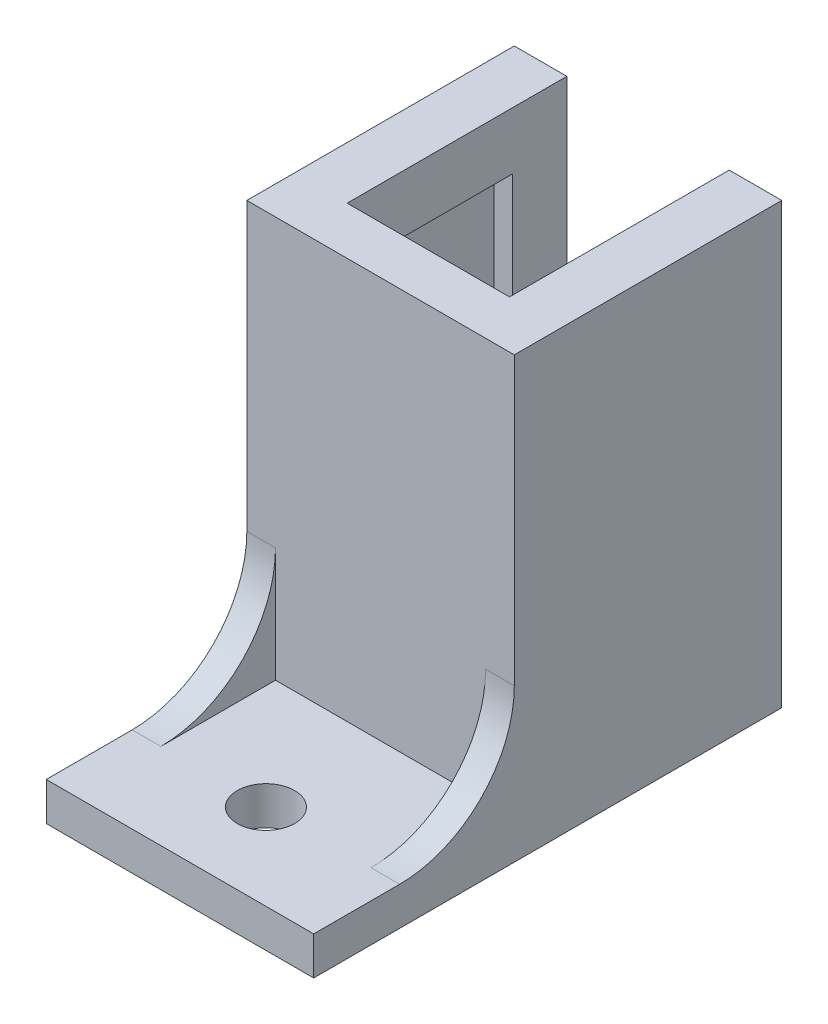
ISO-10303-21;
HEADER;
FILE_DESCRIPTION(('STEP AP214'),'2;1');
FILE_NAME('part.step','',(''),(''),'','','');
FILE_SCHEMA(('AUTOMOTIVE_DESIGN { 1 0 10303 214 1 1 1 1 }'));
ENDSEC;
DATA;
#1=APPLICATION_CONTEXT('core data for automotive mechanical design processes');
#2=APPLICATION_PROTOCOL_DEFINITION('international standard','automotive_design',2000,#1);
#3=PRODUCT_CONTEXT('',#1,'mechanical');
#4=PRODUCT('Part','Part','',(#3));
#5=PRODUCT_RELATED_PRODUCT_CATEGORY('part','',(#4));
#6=PRODUCT_DEFINITION_FORMATION('','',#4);
#7=PRODUCT_DEFINITION_CONTEXT('part definition',#1,'design');
#8=PRODUCT_DEFINITION('design','',#6,#7);
#9=PRODUCT_DEFINITION_SHAPE('','',#8);
#10=(LENGTH_UNIT() NAMED_UNIT(*) SI_UNIT(.MILLI.,.METRE.));
#11=(NAMED_UNIT(*) PLANE_ANGLE_UNIT() SI_UNIT($,.RADIAN.));
#12=(NAMED_UNIT(*) SI_UNIT($,.STERADIAN.) SOLID_ANGLE_UNIT());
#13=UNCERTAINTY_MEASURE_WITH_UNIT(LENGTH_MEASURE(1.E-05),#10,'distance_accuracy_value','');
#14=(GEOMETRIC_REPRESENTATION_CONTEXT(3) GLOBAL_UNCERTAINTY_ASSIGNED_CONTEXT((#13)) GLOBAL_UNIT_ASSIGNED_CONTEXT((#10,
#11,#12)) REPRESENTATION_CONTEXT('',''));
#15=CARTESIAN_POINT('',(0.,0.,0.));
#16=DIRECTION('',(0.,0.,1.));
#17=DIRECTION('',(1.,0.,0.));
#18=AXIS2_PLACEMENT_3D('',#15,#16,#17);
#19=CARTESIAN_POINT('',(0.,0.,0.));
#20=DIRECTION('',(0.,0.,1.));
#21=DIRECTION('',(1.,0.,0.));
#22=AXIS2_PLACEMENT_3D('',#19,#20,#21);
#23=PLANE('',#22);
#24=DIRECTION('',(0.,-1.,0.));
#25=VECTOR('',#24,1.);
#26=CARTESIAN_POINT('',(4.25,8.5,0.));
#27=LINE('',#26,#25);
#28=CARTESIAN_POINT('',(4.25,11.5,0.));
#29=VERTEX_POINT('',#28);
#30=CARTESIAN_POINT('',(4.25,-11.5,0.));
#31=VERTEX_POINT('',#30);
#32=EDGE_CURVE('E340',#29,#31,#27,.T.);
#33=ORIENTED_EDGE('',*,*,#32,.F.);
#34=DIRECTION('',(-1.,0.,0.));
#35=VECTOR('',#34,1.);
#36=CARTESIAN_POINT('',(0.,11.5,0.));
#37=LINE('',#36,#35);
#38=CARTESIAN_POINT('',(7.,11.5,0.));
#39=VERTEX_POINT('',#38);
#40=EDGE_CURVE('E200',#39,#29,#37,.T.);
#41=ORIENTED_EDGE('',*,*,#40,.F.);
#42=DIRECTION('',(0.,-1.,0.));
#43=VECTOR('',#42,1.);
#44=CARTESIAN_POINT('',(7.,0.,0.));
#45=LINE('',#44,#43);
#46=CARTESIAN_POINT('',(7.,-11.5,0.));
#47=VERTEX_POINT('',#46);
#48=EDGE_CURVE('E357',#39,#47,#45,.T.);
#49=ORIENTED_EDGE('',*,*,#48,.T.);
#50=DIRECTION('',(-1.,0.,0.));
#51=VECTOR('',#50,1.);
#52=CARTESIAN_POINT('',(0.,-11.5,0.));
#53=LINE('',#52,#51);
#54=EDGE_CURVE('E372',#47,#31,#53,.T.);
#55=ORIENTED_EDGE('',*,*,#54,.T.);
#56=EDGE_LOOP('',(#33,#41,#49,#55));
#57=FACE_BOUND('',#56,.T.);
#58=ADVANCED_FACE('F41',(#57),#23,.F.);
#59=CARTESIAN_POINT('',(0.,8.5,0.));
#60=DIRECTION('',(0.,-1.,0.));
#61=DIRECTION('',(1.,0.,0.));
#62=AXIS2_PLACEMENT_3D('',#59,#60,#61);
#63=PLANE('',#62);
#64=DIRECTION('',(0.,0.,1.));
#65=VECTOR('',#64,1.);
#66=CARTESIAN_POINT('',(4.25,8.5,0.));
#67=LINE('',#66,#65);
#68=CARTESIAN_POINT('',(4.25,8.5,2.85));
#69=VERTEX_POINT('',#68);
#70=CARTESIAN_POINT('',(4.25,8.5,11.5));
#71=VERTEX_POINT('',#70);
#72=EDGE_CURVE('E11',#69,#71,#67,.T.);
#73=ORIENTED_EDGE('',*,*,#72,.F.);
#74=DIRECTION('',(-1.,0.,0.));
#75=VECTOR('',#74,1.);
#76=CARTESIAN_POINT('',(0.,8.5,2.85));
#77=LINE('',#76,#75);
#78=CARTESIAN_POINT('',(5.2,8.5,2.85));
#79=VERTEX_POINT('',#78);
#80=EDGE_CURVE('E296',#79,#69,#77,.T.);
#81=ORIENTED_EDGE('',*,*,#80,.F.);
#82=DIRECTION('',(0.,0.,1.));
#83=VECTOR('',#82,1.);
#84=CARTESIAN_POINT('',(5.2,8.5,0.));
#85=LINE('',#84,#83);
#86=CARTESIAN_POINT('',(5.2,8.5,11.5));
#87=VERTEX_POINT('',#86);
#88=EDGE_CURVE('E297',#79,#87,#85,.T.);
#89=ORIENTED_EDGE('',*,*,#88,.T.);
#90=DIRECTION('',(-1.,0.,0.));
#91=VECTOR('',#90,1.);
#92=CARTESIAN_POINT('',(0.,8.5,11.5));
#93=LINE('',#92,#91);
#94=EDGE_CURVE('E302',#87,#71,#93,.T.);
#95=ORIENTED_EDGE('',*,*,#94,.T.);
#96=EDGE_LOOP('',(#73,#81,#89,#95));
#97=FACE_BOUND('',#96,.T.);
#98=ADVANCED_FACE('F461',(#97),#63,.T.);
#99=CARTESIAN_POINT('',(0.,0.,14.));
#100=DIRECTION('',(0.,0.,1.));
#101=DIRECTION('',(1.,0.,0.));
#102=AXIS2_PLACEMENT_3D('',#99,#100,#101);
#103=PLANE('',#102);
#104=DIRECTION('',(0.,-1.,0.));
#105=VECTOR('',#104,1.);
#106=CARTESIAN_POINT('',(5.5,-3.5,14.));
#107=LINE('',#106,#105);
#108=CARTESIAN_POINT('',(5.5,-3.5,14.));
#109=VERTEX_POINT('',#108);
#110=CARTESIAN_POINT('',(5.5,-9.5,14.));
#111=VERTEX_POINT('',#110);
#112=EDGE_CURVE('E217',#109,#111,#107,.T.);
#113=ORIENTED_EDGE('',*,*,#112,.F.);
#114=DIRECTION('',(1.,0.,0.));
#115=VECTOR('',#114,1.);
#116=CARTESIAN_POINT('',(5.5,-3.5,14.));
#117=LINE('',#116,#115);
#118=CARTESIAN_POINT('',(7.,-3.5,14.));
#119=VERTEX_POINT('',#118);
#120=EDGE_CURVE('E223',#109,#119,#117,.T.);
#121=ORIENTED_EDGE('',*,*,#120,.T.);
#122=DIRECTION('',(0.,-1.,0.));
#123=VECTOR('',#122,1.);
#124=CARTESIAN_POINT('',(7.,0.,14.));
#125=LINE('',#124,#123);
#126=CARTESIAN_POINT('',(7.,11.5,14.));
#127=VERTEX_POINT('',#126);
#128=EDGE_CURVE('E361',#127,#119,#125,.T.);
#129=ORIENTED_EDGE('',*,*,#128,.F.);
#130=DIRECTION('',(-1.,0.,0.));
#131=VECTOR('',#130,1.);
#132=CARTESIAN_POINT('',(0.,11.5,14.));
#133=LINE('',#132,#131);
#134=CARTESIAN_POINT('',(-7.,11.5,14.));
#135=VERTEX_POINT('',#134);
#136=EDGE_CURVE('E352',#127,#135,#133,.T.);
#137=ORIENTED_EDGE('',*,*,#136,.T.);
#138=DIRECTION('',(0.,-1.,0.));
#139=VECTOR('',#138,1.);
#140=CARTESIAN_POINT('',(-7.,0.,14.));
#141=LINE('',#140,#139);
#142=CARTESIAN_POINT('',(-7.,-3.5,14.));
#143=VERTEX_POINT('',#142);
#144=EDGE_CURVE('E356',#135,#143,#141,.T.);
#145=ORIENTED_EDGE('',*,*,#144,.T.);
#146=DIRECTION('',(-1.,0.,0.));
#147=VECTOR('',#146,1.);
#148=CARTESIAN_POINT('',(-5.5,-3.5,14.));
#149=LINE('',#148,#147);
#150=CARTESIAN_POINT('',(-5.5,-3.5,14.));
#151=VERTEX_POINT('',#150);
#152=EDGE_CURVE('E242',#151,#143,#149,.T.);
#153=ORIENTED_EDGE('',*,*,#152,.F.);
#154=DIRECTION('',(0.,-1.,0.));
#155=VECTOR('',#154,1.);
#156=CARTESIAN_POINT('',(-5.5,-3.5,14.));
#157=LINE('',#156,#155);
#158=CARTESIAN_POINT('',(-5.5,-9.5,14.));
#159=VERTEX_POINT('',#158);
#160=EDGE_CURVE('E234',#151,#159,#157,.T.);
#161=ORIENTED_EDGE('',*,*,#160,.T.);
#162=DIRECTION('',(1.,0.,0.));
#163=VECTOR('',#162,1.);
#164=CARTESIAN_POINT('',(7.,-9.5,14.));
#165=LINE('',#164,#163);
#166=EDGE_CURVE('E272',#159,#111,#165,.T.);
#167=ORIENTED_EDGE('',*,*,#166,.T.);
#168=EDGE_LOOP('',(#113,#121,#129,#137,#145,#153,#161,#167));
#169=FACE_BOUND('',#168,.T.);
#170=ADVANCED_FACE('F420',(#169),#103,.T.);
#171=CARTESIAN_POINT('',(0.,-9.5,0.));
#172=DIRECTION('',(0.,-1.,0.));
#173=DIRECTION('',(1.,0.,0.));
#174=AXIS2_PLACEMENT_3D('',#171,#172,#173);
#175=PLANE('',#174);
#176=CARTESIAN_POINT('',(0.,-9.5,20.));
#177=DIRECTION('',(0.,-1.,0.));
#178=DIRECTION('',(1.,0.,0.));
#179=AXIS2_PLACEMENT_3D('',#176,#177,#178);
#180=CIRCLE('',#179,1.5);
#181=CARTESIAN_POINT('',(1.5,-9.5,20.));
#182=VERTEX_POINT('',#181);
#183=EDGE_CURVE('E253',#182,#182,#180,.T.);
#184=ORIENTED_EDGE('',*,*,#183,.T.);
#185=EDGE_LOOP('',(#184));
#186=FACE_BOUND('',#185,.T.);
#187=DIRECTION('',(1.,0.,0.));
#188=VECTOR('',#187,1.);
#189=CARTESIAN_POINT('',(5.5,-9.5,20.));
#190=LINE('',#189,#188);
#191=CARTESIAN_POINT('',(5.5,-9.5,20.));
#192=VERTEX_POINT('',#191);
#193=CARTESIAN_POINT('',(7.,-9.5,20.));
#194=VERTEX_POINT('',#193);
#195=EDGE_CURVE('E220',#192,#194,#190,.T.);
#196=ORIENTED_EDGE('',*,*,#195,.F.);
#197=DIRECTION('',(0.,0.,1.));
#198=VECTOR('',#197,1.);
#199=CARTESIAN_POINT('',(5.5,-9.5,14.));
#200=LINE('',#199,#198);
#201=EDGE_CURVE('E214',#111,#192,#200,.T.);
#202=ORIENTED_EDGE('',*,*,#201,.F.);
#203=ORIENTED_EDGE('',*,*,#166,.F.);
#204=DIRECTION('',(0.,0.,1.));
#205=VECTOR('',#204,1.);
#206=CARTESIAN_POINT('',(-5.5,-9.5,14.));
#207=LINE('',#206,#205);
#208=CARTESIAN_POINT('',(-5.5,-9.5,20.));
#209=VERTEX_POINT('',#208);
#210=EDGE_CURVE('E238',#159,#209,#207,.T.);
#211=ORIENTED_EDGE('',*,*,#210,.T.);
#212=DIRECTION('',(-1.,0.,0.));
#213=VECTOR('',#212,1.);
#214=CARTESIAN_POINT('',(-5.5,-9.5,20.));
#215=LINE('',#214,#213);
#216=CARTESIAN_POINT('',(-7.,-9.5,20.));
#217=VERTEX_POINT('',#216);
#218=EDGE_CURVE('E246',#209,#217,#215,.T.);
#219=ORIENTED_EDGE('',*,*,#218,.T.);
#220=DIRECTION('',(0.,0.,-1.));
#221=VECTOR('',#220,1.);
#222=CARTESIAN_POINT('',(-7.,-9.5,14.));
#223=LINE('',#222,#221);
#224=CARTESIAN_POINT('',(-7.,-9.5,24.5));
#225=VERTEX_POINT('',#224);
#226=EDGE_CURVE('E268',#225,#217,#223,.T.);
#227=ORIENTED_EDGE('',*,*,#226,.F.);
#228=DIRECTION('',(-1.,0.,0.));
#229=VECTOR('',#228,1.);
#230=CARTESIAN_POINT('',(7.,-9.5,24.5));
#231=LINE('',#230,#229);
#232=CARTESIAN_POINT('',(7.,-9.5,24.5));
#233=VERTEX_POINT('',#232);
#234=EDGE_CURVE('E264',#233,#225,#231,.T.);
#235=ORIENTED_EDGE('',*,*,#234,.F.);
#236=DIRECTION('',(0.,0.,1.));
#237=VECTOR('',#236,1.);
#238=CARTESIAN_POINT('',(7.,-9.5,14.));
#239=LINE('',#238,#237);
#240=EDGE_CURVE('E261',#194,#233,#239,.T.);
#241=ORIENTED_EDGE('',*,*,#240,.F.);
#242=EDGE_LOOP('',(#196,#202,#203,#211,#219,#227,#235,#241));
#243=FACE_BOUND('',#242,.T.);
#244=ADVANCED_FACE('F415',(#186,#243),#175,.F.);
#245=CARTESIAN_POINT('',(0.,-11.5,14.));
#246=DIRECTION('',(0.,-1.,0.));
#247=DIRECTION('',(1.,0.,0.));
#248=AXIS2_PLACEMENT_3D('',#245,#246,#247);
#249=PLANE('',#248);
#250=DIRECTION('',(-1.,0.,0.));
#251=VECTOR('',#250,1.);
#252=CARTESIAN_POINT('',(0.,-11.5,2.85));
#253=LINE('',#252,#251);
#254=CARTESIAN_POINT('',(5.2,-11.5,2.85));
#255=VERTEX_POINT('',#254);
#256=CARTESIAN_POINT('',(4.25,-11.5,2.85));
#257=VERTEX_POINT('',#256);
#258=EDGE_CURVE('E314',#255,#257,#253,.T.);
#259=ORIENTED_EDGE('',*,*,#258,.T.);
#260=DIRECTION('',(0.,0.,-1.));
#261=VECTOR('',#260,1.);
#262=CARTESIAN_POINT('',(4.25,-11.5,0.));
#263=LINE('',#262,#261);
#264=EDGE_CURVE('E317',#257,#31,#263,.T.);
#265=ORIENTED_EDGE('',*,*,#264,.T.);
#266=ORIENTED_EDGE('',*,*,#54,.F.);
#267=DIRECTION('',(0.,0.,-1.));
#268=VECTOR('',#267,1.);
#269=CARTESIAN_POINT('',(7.,-11.5,14.));
#270=LINE('',#269,#268);
#271=CARTESIAN_POINT('',(7.,-11.5,24.5));
#272=VERTEX_POINT('',#271);
#273=EDGE_CURVE('E381',#272,#47,#270,.T.);
#274=ORIENTED_EDGE('',*,*,#273,.F.);
#275=DIRECTION('',(-1.,0.,0.));
#276=VECTOR('',#275,1.);
#277=CARTESIAN_POINT('',(7.,-11.5,24.5));
#278=LINE('',#277,#276);
#279=CARTESIAN_POINT('',(-7.,-11.5,24.5));
#280=VERTEX_POINT('',#279);
#281=EDGE_CURVE('E257',#272,#280,#278,.T.);
#282=ORIENTED_EDGE('',*,*,#281,.T.);
#283=DIRECTION('',(0.,0.,-1.));
#284=VECTOR('',#283,1.);
#285=CARTESIAN_POINT('',(-7.,-11.5,14.));
#286=LINE('',#285,#284);
#287=CARTESIAN_POINT('',(-7.,-11.5,0.));
#288=VERTEX_POINT('',#287);
#289=EDGE_CURVE('E384',#280,#288,#286,.T.);
#290=ORIENTED_EDGE('',*,*,#289,.T.);
#291=CARTESIAN_POINT('',(-4.25,-11.5,0.));
#292=VERTEX_POINT('',#291);
#293=EDGE_CURVE('E371',#292,#288,#53,.T.);
#294=ORIENTED_EDGE('',*,*,#293,.F.);
#295=DIRECTION('',(0.,0.,-1.));
#296=VECTOR('',#295,1.);
#297=CARTESIAN_POINT('',(-4.25,-11.5,0.));
#298=LINE('',#297,#296);
#299=CARTESIAN_POINT('',(-4.25,-11.5,2.85));
#300=VERTEX_POINT('',#299);
#301=EDGE_CURVE('E313',#300,#292,#298,.T.);
#302=ORIENTED_EDGE('',*,*,#301,.F.);
#303=CARTESIAN_POINT('',(-5.2,-11.5,2.85));
#304=VERTEX_POINT('',#303);
#305=EDGE_CURVE('E309',#300,#304,#253,.T.);
#306=ORIENTED_EDGE('',*,*,#305,.T.);
#307=DIRECTION('',(0.,0.,1.));
#308=VECTOR('',#307,1.);
#309=CARTESIAN_POINT('',(-5.2,-11.5,0.));
#310=LINE('',#309,#308);
#311=CARTESIAN_POINT('',(-5.2,-11.5,11.5));
#312=VERTEX_POINT('',#311);
#313=EDGE_CURVE('E284',#304,#312,#310,.T.);
#314=ORIENTED_EDGE('',*,*,#313,.T.);
#315=DIRECTION('',(-1.,0.,0.));
#316=VECTOR('',#315,1.);
#317=CARTESIAN_POINT('',(0.,-11.5,11.5));
#318=LINE('',#317,#316);
#319=CARTESIAN_POINT('',(5.2,-11.5,11.5));
#320=VERTEX_POINT('',#319);
#321=EDGE_CURVE('E293',#320,#312,#318,.T.);
#322=ORIENTED_EDGE('',*,*,#321,.F.);
#323=DIRECTION('',(0.,0.,1.));
#324=VECTOR('',#323,1.);
#325=CARTESIAN_POINT('',(5.2,-11.5,0.));
#326=LINE('',#325,#324);
#327=EDGE_CURVE('E321',#255,#320,#326,.T.);
#328=ORIENTED_EDGE('',*,*,#327,.F.);
#329=EDGE_LOOP('',(#259,#265,#266,#274,#282,#290,#294,#302,#306,#314,#322,#328));
#330=FACE_BOUND('',#329,.T.);
#331=CARTESIAN_POINT('',(0.,-11.5,20.));
#332=DIRECTION('',(0.,-1.,0.));
#333=DIRECTION('',(1.,0.,0.));
#334=AXIS2_PLACEMENT_3D('',#331,#332,#333);
#335=CIRCLE('',#334,1.5);
#336=CARTESIAN_POINT('',(1.5,-11.5,20.));
#337=VERTEX_POINT('',#336);
#338=EDGE_CURVE('E250',#337,#337,#335,.T.);
#339=ORIENTED_EDGE('',*,*,#338,.F.);
#340=EDGE_LOOP('',(#339));
#341=FACE_BOUND('',#340,.T.);
#342=ADVANCED_FACE('F404',(#330,#341),#249,.T.);
#343=CARTESIAN_POINT('',(-4.25,11.5,0.));
#344=VERTEX_POINT('',#343);
#345=CARTESIAN_POINT('',(-7.,11.5,0.));
#346=VERTEX_POINT('',#345);
#347=EDGE_CURVE('E330',#344,#346,#37,.T.);
#348=ORIENTED_EDGE('',*,*,#347,.F.);
#349=DIRECTION('',(0.,-1.,0.));
#350=VECTOR('',#349,1.);
#351=CARTESIAN_POINT('',(-4.25,8.5,0.));
#352=LINE('',#351,#350);
#353=EDGE_CURVE('E343',#344,#292,#352,.T.);
#354=ORIENTED_EDGE('',*,*,#353,.T.);
#355=ORIENTED_EDGE('',*,*,#293,.T.);
#356=DIRECTION('',(0.,-1.,0.));
#357=VECTOR('',#356,1.);
#358=CARTESIAN_POINT('',(-7.,0.,0.));
#359=LINE('',#358,#357);
#360=EDGE_CURVE('E367',#346,#288,#359,.T.);
#361=ORIENTED_EDGE('',*,*,#360,.F.);
#362=EDGE_LOOP('',(#348,#354,#355,#361));
#363=FACE_BOUND('',#362,.T.);
#364=ADVANCED_FACE('F398',(#363),#23,.F.);
#365=CARTESIAN_POINT('',(0.,11.5,14.));
#366=DIRECTION('',(0.,-1.,0.));
#367=DIRECTION('',(1.,0.,0.));
#368=AXIS2_PLACEMENT_3D('',#365,#366,#367);
#369=PLANE('',#368);
#370=ORIENTED_EDGE('',*,*,#40,.T.);
#371=DIRECTION('',(0.,0.,1.));
#372=VECTOR('',#371,1.);
#373=CARTESIAN_POINT('',(4.25,11.5,0.));
#374=LINE('',#373,#372);
#375=CARTESIAN_POINT('',(4.25,11.5,11.5));
#376=VERTEX_POINT('',#375);
#377=EDGE_CURVE('E181',#29,#376,#374,.T.);
#378=ORIENTED_EDGE('',*,*,#377,.T.);
#379=DIRECTION('',(-1.,0.,0.));
#380=VECTOR('',#379,1.);
#381=CARTESIAN_POINT('',(4.25,11.5,11.5));
#382=LINE('',#381,#380);
#383=CARTESIAN_POINT('',(-4.25,11.5,11.5));
#384=VERTEX_POINT('',#383);
#385=EDGE_CURVE('E190',#376,#384,#382,.T.);
#386=ORIENTED_EDGE('',*,*,#385,.T.);
#387=DIRECTION('',(0.,0.,-1.));
#388=VECTOR('',#387,1.);
#389=CARTESIAN_POINT('',(-4.25,11.5,0.));
#390=LINE('',#389,#388);
#391=EDGE_CURVE('E187',#384,#344,#390,.T.);
#392=ORIENTED_EDGE('',*,*,#391,.T.);
#393=ORIENTED_EDGE('',*,*,#347,.T.);
#394=DIRECTION('',(0.,0.,-1.));
#395=VECTOR('',#394,1.);
#396=CARTESIAN_POINT('',(-7.,11.5,14.));
#397=LINE('',#396,#395);
#398=EDGE_CURVE('E50',#135,#346,#397,.T.);
#399=ORIENTED_EDGE('',*,*,#398,.F.);
#400=ORIENTED_EDGE('',*,*,#136,.F.);
#401=DIRECTION('',(0.,0.,-1.));
#402=VECTOR('',#401,1.);
#403=CARTESIAN_POINT('',(7.,11.5,14.));
#404=LINE('',#403,#402);
#405=EDGE_CURVE('E364',#127,#39,#404,.T.);
#406=ORIENTED_EDGE('',*,*,#405,.T.);
#407=EDGE_LOOP('',(#370,#378,#386,#392,#393,#399,#400,#406));
#408=FACE_BOUND('',#407,.T.);
#409=ADVANCED_FACE('F43',(#408),#369,.F.);
#410=CARTESIAN_POINT('',(-7.,0.,14.));
#411=DIRECTION('',(1.,0.,0.));
#412=DIRECTION('',(0.,1.,0.));
#413=AXIS2_PLACEMENT_3D('',#410,#411,#412);
#414=PLANE('',#413);
#415=ORIENTED_EDGE('',*,*,#360,.T.);
#416=ORIENTED_EDGE('',*,*,#289,.F.);
#417=DIRECTION('',(0.,-1.,0.));
#418=VECTOR('',#417,1.);
#419=CARTESIAN_POINT('',(-7.,-9.5,24.5));
#420=LINE('',#419,#418);
#421=EDGE_CURVE('E280',#225,#280,#420,.T.);
#422=ORIENTED_EDGE('',*,*,#421,.F.);
#423=ORIENTED_EDGE('',*,*,#226,.T.);
#424=CARTESIAN_POINT('',(-7.,-3.5,20.));
#425=DIRECTION('',(1.,0.,0.));
#426=DIRECTION('',(0.,1.,0.));
#427=AXIS2_PLACEMENT_3D('',#424,#425,#426);
#428=CIRCLE('',#427,6.);
#429=EDGE_CURVE('E227',#217,#143,#428,.T.);
#430=ORIENTED_EDGE('',*,*,#429,.T.);
#431=ORIENTED_EDGE('',*,*,#144,.F.);
#432=ORIENTED_EDGE('',*,*,#398,.T.);
#433=EDGE_LOOP('',(#415,#416,#422,#423,#430,#431,#432));
#434=FACE_BOUND('',#433,.T.);
#435=ADVANCED_FACE('F391',(#434),#414,.F.);
#436=CARTESIAN_POINT('',(7.,0.,14.));
#437=DIRECTION('',(1.,0.,0.));
#438=DIRECTION('',(0.,1.,0.));
#439=AXIS2_PLACEMENT_3D('',#436,#437,#438);
#440=PLANE('',#439);
#441=ORIENTED_EDGE('',*,*,#48,.F.);
#442=ORIENTED_EDGE('',*,*,#405,.F.);
#443=ORIENTED_EDGE('',*,*,#128,.T.);
#444=CARTESIAN_POINT('',(7.,-3.5,20.));
#445=DIRECTION('',(1.,0.,0.));
#446=DIRECTION('',(0.,1.,0.));
#447=AXIS2_PLACEMENT_3D('',#444,#445,#446);
#448=CIRCLE('',#447,6.);
#449=EDGE_CURVE('E64',#194,#119,#448,.T.);
#450=ORIENTED_EDGE('',*,*,#449,.F.);
#451=ORIENTED_EDGE('',*,*,#240,.T.);
#452=DIRECTION('',(0.,-1.,0.));
#453=VECTOR('',#452,1.);
#454=CARTESIAN_POINT('',(7.,-9.5,24.5));
#455=LINE('',#454,#453);
#456=EDGE_CURVE('E276',#233,#272,#455,.T.);
#457=ORIENTED_EDGE('',*,*,#456,.T.);
#458=ORIENTED_EDGE('',*,*,#273,.T.);
#459=EDGE_LOOP('',(#441,#442,#443,#450,#451,#457,#458));
#460=FACE_BOUND('',#459,.T.);
#461=ADVANCED_FACE('F423',(#460),#440,.T.);
#462=CARTESIAN_POINT('',(-5.2,8.5,0.));
#463=DIRECTION('',(1.,0.,0.));
#464=DIRECTION('',(0.,1.,0.));
#465=AXIS2_PLACEMENT_3D('',#462,#463,#464);
#466=PLANE('',#465);
#467=ORIENTED_EDGE('',*,*,#313,.F.);
#468=DIRECTION('',(0.,-1.,0.));
#469=VECTOR('',#468,1.);
#470=CARTESIAN_POINT('',(-5.2,8.5,2.85));
#471=LINE('',#470,#469);
#472=CARTESIAN_POINT('',(-5.2,8.5,2.85));
#473=VERTEX_POINT('',#472);
#474=EDGE_CURVE('E305',#473,#304,#471,.T.);
#475=ORIENTED_EDGE('',*,*,#474,.F.);
#476=DIRECTION('',(0.,0.,1.));
#477=VECTOR('',#476,1.);
#478=CARTESIAN_POINT('',(-5.2,8.5,0.));
#479=LINE('',#478,#477);
#480=CARTESIAN_POINT('',(-5.2,8.5,11.5));
#481=VERTEX_POINT('',#480);
#482=EDGE_CURVE('E288',#473,#481,#479,.T.);
#483=ORIENTED_EDGE('',*,*,#482,.T.);
#484=DIRECTION('',(0.,-1.,0.));
#485=VECTOR('',#484,1.);
#486=CARTESIAN_POINT('',(-5.2,8.5,11.5));
#487=LINE('',#486,#485);
#488=EDGE_CURVE('E327',#481,#312,#487,.T.);
#489=ORIENTED_EDGE('',*,*,#488,.T.);
#490=EDGE_LOOP('',(#467,#475,#483,#489));
#491=FACE_BOUND('',#490,.T.);
#492=ADVANCED_FACE('F443',(#491),#466,.T.);
#493=CARTESIAN_POINT('',(0.,8.5,11.5));
#494=DIRECTION('',(0.,0.,1.));
#495=DIRECTION('',(1.,0.,0.));
#496=AXIS2_PLACEMENT_3D('',#493,#494,#495);
#497=PLANE('',#496);
#498=ORIENTED_EDGE('',*,*,#321,.T.);
#499=ORIENTED_EDGE('',*,*,#488,.F.);
#500=CARTESIAN_POINT('',(-4.25,8.5,11.5));
#501=VERTEX_POINT('',#500);
#502=EDGE_CURVE('E301',#501,#481,#93,.T.);
#503=ORIENTED_EDGE('',*,*,#502,.F.);
#504=DIRECTION('',(0.,-1.,0.));
#505=VECTOR('',#504,1.);
#506=CARTESIAN_POINT('',(-4.25,11.5,11.5));
#507=LINE('',#506,#505);
#508=EDGE_CURVE('E186',#384,#501,#507,.T.);
#509=ORIENTED_EDGE('',*,*,#508,.F.);
#510=ORIENTED_EDGE('',*,*,#385,.F.);
#511=DIRECTION('',(0.,-1.,0.));
#512=VECTOR('',#511,1.);
#513=CARTESIAN_POINT('',(4.25,11.5,11.5));
#514=LINE('',#513,#512);
#515=EDGE_CURVE('E57',#376,#71,#514,.T.);
#516=ORIENTED_EDGE('',*,*,#515,.T.);
#517=ORIENTED_EDGE('',*,*,#94,.F.);
#518=DIRECTION('',(0.,-1.,0.));
#519=VECTOR('',#518,1.);
#520=CARTESIAN_POINT('',(5.2,8.5,11.5));
#521=LINE('',#520,#519);
#522=EDGE_CURVE('E331',#87,#320,#521,.T.);
#523=ORIENTED_EDGE('',*,*,#522,.T.);
#524=EDGE_LOOP('',(#498,#499,#503,#509,#510,#516,#517,#523));
#525=FACE_BOUND('',#524,.T.);
#526=ADVANCED_FACE('F192',(#525),#497,.F.);
#527=CARTESIAN_POINT('',(5.2,8.5,0.));
#528=DIRECTION('',(1.,0.,0.));
#529=DIRECTION('',(0.,1.,0.));
#530=AXIS2_PLACEMENT_3D('',#527,#528,#529);
#531=PLANE('',#530);
#532=ORIENTED_EDGE('',*,*,#327,.T.);
#533=ORIENTED_EDGE('',*,*,#522,.F.);
#534=ORIENTED_EDGE('',*,*,#88,.F.);
#535=DIRECTION('',(0.,-1.,0.));
#536=VECTOR('',#535,1.);
#537=CARTESIAN_POINT('',(5.2,8.5,2.85));
#538=LINE('',#537,#536);
#539=EDGE_CURVE('E334',#79,#255,#538,.T.);
#540=ORIENTED_EDGE('',*,*,#539,.T.);
#541=EDGE_LOOP('',(#532,#533,#534,#540));
#542=FACE_BOUND('',#541,.T.);
#543=ADVANCED_FACE('F491',(#542),#531,.F.);
#544=CARTESIAN_POINT('',(0.,8.5,2.85));
#545=DIRECTION('',(0.,0.,1.));
#546=DIRECTION('',(1.,0.,0.));
#547=AXIS2_PLACEMENT_3D('',#544,#545,#546);
#548=PLANE('',#547);
#549=ORIENTED_EDGE('',*,*,#258,.F.);
#550=ORIENTED_EDGE('',*,*,#539,.F.);
#551=ORIENTED_EDGE('',*,*,#80,.T.);
#552=DIRECTION('',(0.,-1.,0.));
#553=VECTOR('',#552,1.);
#554=CARTESIAN_POINT('',(4.25,8.5,2.85));
#555=LINE('',#554,#553);
#556=EDGE_CURVE('E337',#69,#257,#555,.T.);
#557=ORIENTED_EDGE('',*,*,#556,.T.);
#558=EDGE_LOOP('',(#549,#550,#551,#557));
#559=FACE_BOUND('',#558,.T.);
#560=ADVANCED_FACE('F457',(#559),#548,.T.);
#561=CARTESIAN_POINT('',(4.25,8.5,0.));
#562=DIRECTION('',(-1.,0.,0.));
#563=DIRECTION('',(0.,0.,1.));
#564=AXIS2_PLACEMENT_3D('',#561,#562,#563);
#565=PLANE('',#564);
#566=ORIENTED_EDGE('',*,*,#264,.F.);
#567=ORIENTED_EDGE('',*,*,#556,.F.);
#568=ORIENTED_EDGE('',*,*,#72,.T.);
#569=ORIENTED_EDGE('',*,*,#515,.F.);
#570=ORIENTED_EDGE('',*,*,#377,.F.);
#571=ORIENTED_EDGE('',*,*,#32,.T.);
#572=EDGE_LOOP('',(#566,#567,#568,#569,#570,#571));
#573=FACE_BOUND('',#572,.T.);
#574=ADVANCED_FACE('F179',(#573),#565,.T.);
#575=CARTESIAN_POINT('',(-4.25,8.5,0.));
#576=DIRECTION('',(-1.,0.,0.));
#577=DIRECTION('',(0.,0.,1.));
#578=AXIS2_PLACEMENT_3D('',#575,#576,#577);
#579=PLANE('',#578);
#580=ORIENTED_EDGE('',*,*,#301,.T.);
#581=ORIENTED_EDGE('',*,*,#353,.F.);
#582=ORIENTED_EDGE('',*,*,#391,.F.);
#583=ORIENTED_EDGE('',*,*,#508,.T.);
#584=DIRECTION('',(0.,0.,-1.));
#585=VECTOR('',#584,1.);
#586=CARTESIAN_POINT('',(-4.25,8.5,0.));
#587=LINE('',#586,#585);
#588=CARTESIAN_POINT('',(-4.25,8.5,2.85));
#589=VERTEX_POINT('',#588);
#590=EDGE_CURVE('E202',#501,#589,#587,.T.);
#591=ORIENTED_EDGE('',*,*,#590,.T.);
#592=DIRECTION('',(0.,-1.,0.));
#593=VECTOR('',#592,1.);
#594=CARTESIAN_POINT('',(-4.25,8.5,2.85));
#595=LINE('',#594,#593);
#596=EDGE_CURVE('E347',#589,#300,#595,.T.);
#597=ORIENTED_EDGE('',*,*,#596,.T.);
#598=EDGE_LOOP('',(#580,#581,#582,#583,#591,#597));
#599=FACE_BOUND('',#598,.T.);
#600=ADVANCED_FACE('F449',(#599),#579,.F.);
#601=ORIENTED_EDGE('',*,*,#305,.F.);
#602=ORIENTED_EDGE('',*,*,#596,.F.);
#603=EDGE_CURVE('E292',#589,#473,#77,.T.);
#604=ORIENTED_EDGE('',*,*,#603,.T.);
#605=ORIENTED_EDGE('',*,*,#474,.T.);
#606=EDGE_LOOP('',(#601,#602,#604,#605));
#607=FACE_BOUND('',#606,.T.);
#608=ADVANCED_FACE('F447',(#607),#548,.T.);
#609=ORIENTED_EDGE('',*,*,#590,.F.);
#610=ORIENTED_EDGE('',*,*,#502,.T.);
#611=ORIENTED_EDGE('',*,*,#482,.F.);
#612=ORIENTED_EDGE('',*,*,#603,.F.);
#613=EDGE_LOOP('',(#609,#610,#611,#612));
#614=FACE_BOUND('',#613,.T.);
#615=ADVANCED_FACE('F437',(#614),#63,.T.);
#616=CARTESIAN_POINT('',(7.,-9.5,24.5));
#617=DIRECTION('',(0.,0.,1.));
#618=DIRECTION('',(1.,0.,0.));
#619=AXIS2_PLACEMENT_3D('',#616,#617,#618);
#620=PLANE('',#619);
#621=ORIENTED_EDGE('',*,*,#281,.F.);
#622=ORIENTED_EDGE('',*,*,#456,.F.);
#623=ORIENTED_EDGE('',*,*,#234,.T.);
#624=ORIENTED_EDGE('',*,*,#421,.T.);
#625=EDGE_LOOP('',(#621,#622,#623,#624));
#626=FACE_BOUND('',#625,.T.);
#627=ADVANCED_FACE('F409',(#626),#620,.T.);
#628=CARTESIAN_POINT('',(0.,-9.5,20.));
#629=DIRECTION('',(0.,-1.,0.));
#630=DIRECTION('',(1.,0.,0.));
#631=AXIS2_PLACEMENT_3D('',#628,#629,#630);
#632=CYLINDRICAL_SURFACE('',#631,1.5);
#633=ORIENTED_EDGE('',*,*,#183,.F.);
#634=EDGE_LOOP('',(#633));
#635=FACE_BOUND('',#634,.T.);
#636=ORIENTED_EDGE('',*,*,#338,.T.);
#637=EDGE_LOOP('',(#636));
#638=FACE_BOUND('',#637,.T.);
#639=ADVANCED_FACE('F605',(#635,#638),#632,.F.);
#640=CARTESIAN_POINT('',(-5.5,-3.5,20.));
#641=DIRECTION('',(-1.,0.,0.));
#642=DIRECTION('',(0.,-1.,0.));
#643=AXIS2_PLACEMENT_3D('',#640,#641,#642);
#644=CYLINDRICAL_SURFACE('',#643,6.);
#645=ORIENTED_EDGE('',*,*,#429,.F.);
#646=ORIENTED_EDGE('',*,*,#218,.F.);
#647=CARTESIAN_POINT('',(-5.5,-3.5,20.));
#648=DIRECTION('',(1.,0.,0.));
#649=DIRECTION('',(0.,1.,0.));
#650=AXIS2_PLACEMENT_3D('',#647,#648,#649);
#651=CIRCLE('',#650,6.);
#652=EDGE_CURVE('E230',#209,#151,#651,.T.);
#653=ORIENTED_EDGE('',*,*,#652,.T.);
#654=ORIENTED_EDGE('',*,*,#152,.T.);
#655=EDGE_LOOP('',(#645,#646,#653,#654));
#656=FACE_BOUND('',#655,.T.);
#657=ADVANCED_FACE('F612',(#656),#644,.F.);
#658=CARTESIAN_POINT('',(-5.5,-3.5,20.));
#659=DIRECTION('',(1.,0.,0.));
#660=DIRECTION('',(0.,1.,0.));
#661=AXIS2_PLACEMENT_3D('',#658,#659,#660);
#662=PLANE('',#661);
#663=ORIENTED_EDGE('',*,*,#652,.F.);
#664=ORIENTED_EDGE('',*,*,#210,.F.);
#665=ORIENTED_EDGE('',*,*,#160,.F.);
#666=EDGE_LOOP('',(#663,#664,#665));
#667=FACE_BOUND('',#666,.T.);
#668=ADVANCED_FACE('F520',(#667),#662,.T.);
#669=CARTESIAN_POINT('',(5.5,-3.5,20.));
#670=DIRECTION('',(1.,0.,0.));
#671=DIRECTION('',(0.,1.,0.));
#672=AXIS2_PLACEMENT_3D('',#669,#670,#671);
#673=CYLINDRICAL_SURFACE('',#672,6.);
#674=ORIENTED_EDGE('',*,*,#449,.T.);
#675=ORIENTED_EDGE('',*,*,#120,.F.);
#676=CARTESIAN_POINT('',(5.5,-3.5,20.));
#677=DIRECTION('',(1.,0.,0.));
#678=DIRECTION('',(0.,1.,0.));
#679=AXIS2_PLACEMENT_3D('',#676,#677,#678);
#680=CIRCLE('',#679,6.);
#681=EDGE_CURVE('E211',#192,#109,#680,.T.);
#682=ORIENTED_EDGE('',*,*,#681,.F.);
#683=ORIENTED_EDGE('',*,*,#195,.T.);
#684=EDGE_LOOP('',(#674,#675,#682,#683));
#685=FACE_BOUND('',#684,.T.);
#686=ADVANCED_FACE('F515',(#685),#673,.F.);
#687=CARTESIAN_POINT('',(5.5,-3.5,20.));
#688=DIRECTION('',(-1.,0.,0.));
#689=DIRECTION('',(0.,1.,0.));
#690=AXIS2_PLACEMENT_3D('',#687,#688,#689);
#691=PLANE('',#690);
#692=ORIENTED_EDGE('',*,*,#681,.T.);
#693=ORIENTED_EDGE('',*,*,#112,.T.);
#694=ORIENTED_EDGE('',*,*,#201,.T.);
#695=EDGE_LOOP('',(#692,#693,#694));
#696=FACE_BOUND('',#695,.T.);
#697=ADVANCED_FACE('F519',(#696),#691,.T.);
#698=CLOSED_SHELL('',(#58,#98,#170,#244,#342,#364,#409,#435,#461,#492,#526,#543,#560,#574,#600,
#608,#615,#627,#639,#657,#668,#686,#697));
#699=MANIFOLD_SOLID_BREP('B2',#698);
#700=ADVANCED_BREP_SHAPE_REPRESENTATION('',(#18,#699),#14);
#701=SHAPE_DEFINITION_REPRESENTATION(#9,#700);
ENDSEC;
END-ISO-10303-21;
